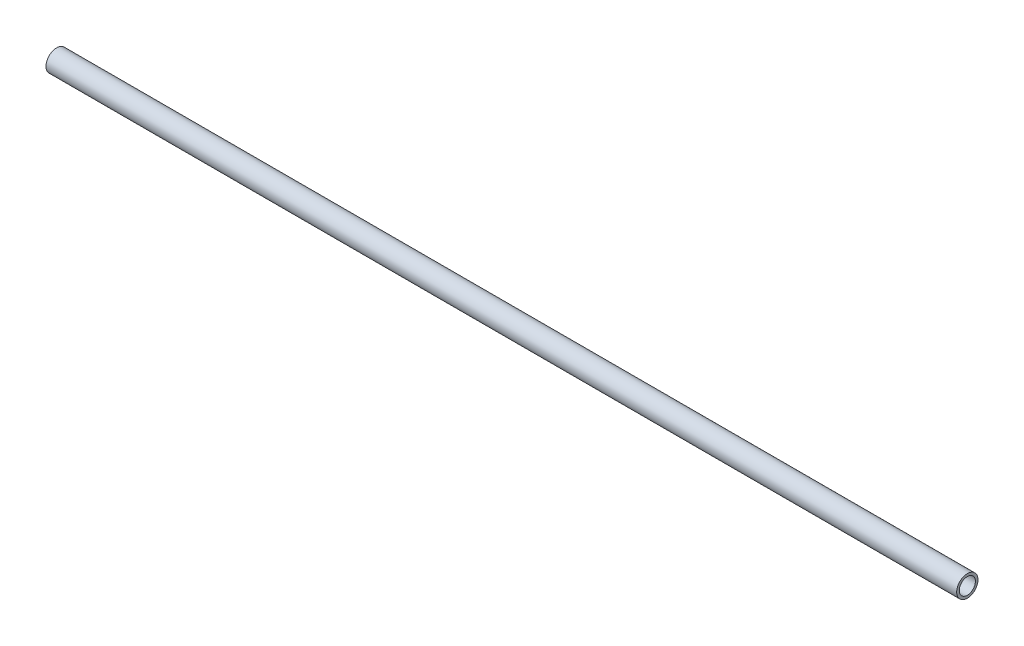
ISO-10303-21;
HEADER;
FILE_DESCRIPTION(('STEP AP214'),'2;1');
FILE_NAME('part.step','',(''),(''),'','','');
FILE_SCHEMA(('AUTOMOTIVE_DESIGN { 1 0 10303 214 1 1 1 1 }'));
ENDSEC;
DATA;
#1=APPLICATION_CONTEXT('core data for automotive mechanical design processes');
#2=APPLICATION_PROTOCOL_DEFINITION('international standard','automotive_design',2000,#1);
#3=PRODUCT_CONTEXT('',#1,'mechanical');
#4=PRODUCT('Part','Part','',(#3));
#5=PRODUCT_RELATED_PRODUCT_CATEGORY('part','',(#4));
#6=PRODUCT_DEFINITION_FORMATION('','',#4);
#7=PRODUCT_DEFINITION_CONTEXT('part definition',#1,'design');
#8=PRODUCT_DEFINITION('design','',#6,#7);
#9=PRODUCT_DEFINITION_SHAPE('','',#8);
#10=(LENGTH_UNIT() NAMED_UNIT(*) SI_UNIT(.MILLI.,.METRE.));
#11=(NAMED_UNIT(*) PLANE_ANGLE_UNIT() SI_UNIT($,.RADIAN.));
#12=(NAMED_UNIT(*) SI_UNIT($,.STERADIAN.) SOLID_ANGLE_UNIT());
#13=UNCERTAINTY_MEASURE_WITH_UNIT(LENGTH_MEASURE(1.E-05),#10,'distance_accuracy_value','');
#14=(GEOMETRIC_REPRESENTATION_CONTEXT(3) GLOBAL_UNCERTAINTY_ASSIGNED_CONTEXT((#13)) GLOBAL_UNIT_ASSIGNED_CONTEXT((#10,
#11,#12)) REPRESENTATION_CONTEXT('',''));
#15=CARTESIAN_POINT('',(0.,0.,0.));
#16=DIRECTION('',(0.,0.,1.));
#17=DIRECTION('',(1.,0.,0.));
#18=AXIS2_PLACEMENT_3D('',#15,#16,#17);
#19=CARTESIAN_POINT('',(90.,0.,0.));
#20=DIRECTION('',(1.,0.,0.));
#21=DIRECTION('',(0.,0.,-1.));
#22=AXIS2_PLACEMENT_3D('',#19,#20,#21);
#23=PLANE('',#22);
#24=CARTESIAN_POINT('',(90.,0.,0.));
#25=DIRECTION('',(1.,0.,0.));
#26=DIRECTION('',(0.,0.,-1.));
#27=AXIS2_PLACEMENT_3D('',#24,#25,#26);
#28=CIRCLE('',#27,1.0541);
#29=CARTESIAN_POINT('',(90.,0.,-1.0541));
#30=VERTEX_POINT('',#29);
#31=EDGE_CURVE('E144',#30,#30,#28,.T.);
#32=ORIENTED_EDGE('',*,*,#31,.T.);
#33=EDGE_LOOP('',(#32));
#34=FACE_BOUND('',#33,.T.);
#35=CARTESIAN_POINT('',(90.,0.,0.));
#36=DIRECTION('',(1.,0.,0.));
#37=DIRECTION('',(0.,0.,-1.));
#38=AXIS2_PLACEMENT_3D('',#35,#36,#37);
#39=CIRCLE('',#38,0.8001);
#40=CARTESIAN_POINT('',(90.,0.,-0.8001));
#41=VERTEX_POINT('',#40);
#42=EDGE_CURVE('E98',#41,#41,#39,.T.);
#43=ORIENTED_EDGE('',*,*,#42,.F.);
#44=EDGE_LOOP('',(#43));
#45=FACE_BOUND('',#44,.T.);
#46=ADVANCED_FACE('F33',(#34,#45),#23,.T.);
#47=CARTESIAN_POINT('',(0.,0.,0.));
#48=DIRECTION('',(1.,0.,0.));
#49=DIRECTION('',(0.,0.,-1.));
#50=AXIS2_PLACEMENT_3D('',#47,#48,#49);
#51=PLANE('',#50);
#52=CARTESIAN_POINT('',(0.,0.,0.));
#53=DIRECTION('',(1.,0.,0.));
#54=DIRECTION('',(0.,0.,-1.));
#55=AXIS2_PLACEMENT_3D('',#52,#53,#54);
#56=CIRCLE('',#55,1.0541);
#57=CARTESIAN_POINT('',(0.,0.,-1.0541));
#58=VERTEX_POINT('',#57);
#59=EDGE_CURVE('E146',#58,#58,#56,.T.);
#60=ORIENTED_EDGE('',*,*,#59,.F.);
#61=EDGE_LOOP('',(#60));
#62=FACE_BOUND('',#61,.T.);
#63=CARTESIAN_POINT('',(0.,0.,0.));
#64=DIRECTION('',(1.,0.,0.));
#65=DIRECTION('',(0.,0.,-1.));
#66=AXIS2_PLACEMENT_3D('',#63,#64,#65);
#67=CIRCLE('',#66,0.8001);
#68=CARTESIAN_POINT('',(0.,0.,-0.8001));
#69=VERTEX_POINT('',#68);
#70=EDGE_CURVE('E95',#69,#69,#67,.T.);
#71=ORIENTED_EDGE('',*,*,#70,.T.);
#72=EDGE_LOOP('',(#71));
#73=FACE_BOUND('',#72,.T.);
#74=ADVANCED_FACE('F158',(#62,#73),#51,.F.);
#75=CARTESIAN_POINT('',(90.,0.,0.));
#76=DIRECTION('',(-1.,0.,0.));
#77=DIRECTION('',(0.,0.,1.));
#78=AXIS2_PLACEMENT_3D('',#75,#76,#77);
#79=CYLINDRICAL_SURFACE('',#78,1.0541);
#80=DIRECTION('',(-1.,0.,0.));
#81=VECTOR('',#80,1.);
#82=CARTESIAN_POINT('',(90.,0.79375,-0.693604892932569));
#83=LINE('',#82,#81);
#84=CARTESIAN_POINT('',(4.22965786459374,0.79375,-0.693604892932567));
#85=VERTEX_POINT('',#84);
#86=CARTESIAN_POINT('',(1.07965786459374,0.79375,-0.693604892932569));
#87=VERTEX_POINT('',#86);
#88=EDGE_CURVE('E94',#85,#87,#83,.T.);
#89=ORIENTED_EDGE('',*,*,#88,.T.);
#90=CARTESIAN_POINT('',(1.07965786459374,0.79375,-0.693604892932567));
#91=CARTESIAN_POINT('',(1.06097650076287,0.793754302158675,-0.69359247993803));
#92=CARTESIAN_POINT('',(1.04231223508289,0.793090191085494,-0.69436031470599));
#93=CARTESIAN_POINT('',(1.005229850283,0.790470009943291,-0.697345228610568));
#94=CARTESIAN_POINT('',(0.986811293598215,0.788516678857944,-0.699559235212214));
#95=CARTESIAN_POINT('',(0.932622122592786,0.780856247540208,-0.708130425039182));
#96=CARTESIAN_POINT('',(0.897397203167143,0.773345984622935,-0.716422927180524));
#97=CARTESIAN_POINT('',(0.829603768208356,0.754155298401055,-0.736590197362163));
#98=CARTESIAN_POINT('',(0.797016823312525,0.742507559504099,-0.748436778719499));
#99=CARTESIAN_POINT('',(0.734239036964473,0.715469484959063,-0.774327217608681));
#100=CARTESIAN_POINT('',(0.704057751250156,0.700065123297631,-0.788379237773462));
#101=CARTESIAN_POINT('',(0.640174312285661,0.662228942353192,-0.820559528642505));
#102=CARTESIAN_POINT('',(0.607063395270207,0.639000712266537,-0.838924192889501));
#103=CARTESIAN_POINT('',(0.544695968844711,0.587778167834582,-0.875578890317217));
#104=CARTESIAN_POINT('',(0.515441644617538,0.559781171875426,-0.893868875545558));
#105=CARTESIAN_POINT('',(0.455527874305952,0.492863450316194,-0.932739772433391));
#106=CARTESIAN_POINT('',(0.425832185773999,0.452881224721931,-0.953010656015409));
#107=CARTESIAN_POINT('',(0.373887659986069,0.36666459507562,-0.989372403012117));
#108=CARTESIAN_POINT('',(0.351622469417229,0.320444239479246,-1.00547242808366));
#109=CARTESIAN_POINT('',(0.321524663051466,0.237860657499026,-1.02751382523747));
#110=CARTESIAN_POINT('',(0.311362500794273,0.202766377829282,-1.03505540472533));
#111=CARTESIAN_POINT('',(0.295926994558195,0.130956300347958,-1.04656329756168));
#112=CARTESIAN_POINT('',(0.29064928151658,0.0942419824980385,-1.05053280598323));
#113=CARTESIAN_POINT('',(0.285291062863292,0.0201199452583417,-1.05456305863377));
#114=CARTESIAN_POINT('',(0.285224336828193,-0.0172893509458742,-1.05461343938904));
#115=CARTESIAN_POINT('',(0.29032655497621,-0.0915462594727918,-1.05077537273126));
#116=CARTESIAN_POINT('',(0.295496690386011,-0.12839374206428,-1.04688602915075));
#117=CARTESIAN_POINT('',(0.31048570658938,-0.199193420608315,-1.03570739670066));
#118=CARTESIAN_POINT('',(0.320135685550259,-0.233201804717662,-1.02854176946564));
#119=CARTESIAN_POINT('',(0.343547137371748,-0.298999717571231,-1.01137704762977));
#120=CARTESIAN_POINT('',(0.357309575166656,-0.33078872340566,-1.00137728806549));
#121=CARTESIAN_POINT('',(0.390121038311679,-0.394987028174313,-0.977958224162252));
#122=CARTESIAN_POINT('',(0.409580401573969,-0.42709277051222,-0.964286294346073));
#123=CARTESIAN_POINT('',(0.452321179626761,-0.487714740168385,-0.935091093581731));
#124=CARTESIAN_POINT('',(0.475605424727434,-0.516228281536763,-0.919566454022395));
#125=CARTESIAN_POINT('',(0.530480061376216,-0.574766104604717,-0.884394621527938));
#126=CARTESIAN_POINT('',(0.562802860506998,-0.603978472312668,-0.86453838675115));
#127=CARTESIAN_POINT('',(0.631919569617189,-0.656860939575049,-0.825074353856983));
#128=CARTESIAN_POINT('',(0.66871835348482,-0.680524913942816,-0.805466852699236));
#129=CARTESIAN_POINT('',(0.739124028536789,-0.717873076438503,-0.77219536215681));
#130=CARTESIAN_POINT('',(0.771977428896138,-0.73260181211822,-0.758114459117832));
#131=CARTESIAN_POINT('',(0.840304246182429,-0.757669993472431,-0.733058635643747));
#132=CARTESIAN_POINT('',(0.875763480459972,-0.76803139271991,-0.722068274983034));
#133=CARTESIAN_POINT('',(0.939233432262899,-0.781711212737481,-0.707200978829105));
#134=CARTESIAN_POINT('',(0.966731288222226,-0.786167926359881,-0.702211171973755));
#135=CARTESIAN_POINT('',(1.02267311520765,-0.792213098542312,-0.695365423499634));
#136=CARTESIAN_POINT('',(1.05112348542466,-0.793774641637027,-0.69353890011247));
#137=CARTESIAN_POINT('',(1.07965786459374,-0.79375,-0.693604892932569));
#138=B_SPLINE_CURVE_WITH_KNOTS('',3,(#90,#91,#92,#93,#94,#95,#96,#97,#98,#99,#100,#101,#102,
#103,#104,#105,#106,#107,#108,#109,#110,#111,#112,#113,#114,#115,#116,#117,#118,#119,#120,#121,
#122,#123,#124,#125,#126,#127,#128,#129,#130,#131,#132,#133,#134,#135,#136,#137),.UNSPECIFIED.,
.F.,.F.,(4,2,2,2,2,2,2,2,2,2,2,2,2,2,2,2,2,2,2,2,2,2,2,4),(0.,0.0559864271356696,
0.111854290785416,0.222056996215594,0.3314078268173,0.441173362821062,0.573985149398091,
0.70687186791338,0.867279777259277,1.02733229030916,1.13878139857255,1.25013072074415,
1.36177447748187,1.47344363548265,1.58120744123691,1.68899655222985,1.80842276695392,
1.92793775529119,2.07103339640152,2.2142862728535,2.32990685286528,2.44493909647904,
2.52952236565082,2.61488810970727),.UNSPECIFIED.);
#139=CARTESIAN_POINT('',(1.07965786459374,-0.79375,-0.693604892932569));
#140=VERTEX_POINT('',#139);
#141=EDGE_CURVE('E87',#87,#140,#138,.T.);
#142=ORIENTED_EDGE('',*,*,#141,.T.);
#143=DIRECTION('',(-1.,0.,0.));
#144=VECTOR('',#143,1.);
#145=CARTESIAN_POINT('',(90.,-0.79375,-0.693604892932569));
#146=LINE('',#145,#144);
#147=CARTESIAN_POINT('',(4.22965786459374,-0.79375,-0.693604892932569));
#148=VERTEX_POINT('',#147);
#149=EDGE_CURVE('E76',#140,#148,#146,.F.);
#150=ORIENTED_EDGE('',*,*,#149,.T.);
#151=CARTESIAN_POINT('',(4.22965786459374,-0.79375,-0.693604892932567));
#152=CARTESIAN_POINT('',(4.24833922842462,-0.793754302158675,-0.69359247993803));
#153=CARTESIAN_POINT('',(4.2670034941046,-0.793090191085493,-0.69436031470599));
#154=CARTESIAN_POINT('',(4.30408587890448,-0.790470009943291,-0.697345228610568));
#155=CARTESIAN_POINT('',(4.32250443558927,-0.788516678857944,-0.699559235212214));
#156=CARTESIAN_POINT('',(4.3766936065947,-0.780856247540207,-0.708130425039183));
#157=CARTESIAN_POINT('',(4.41191852602035,-0.773345984622933,-0.716422927180526));
#158=CARTESIAN_POINT('',(4.47971196097914,-0.754155298401051,-0.736590197362166));
#159=CARTESIAN_POINT('',(4.51229890587497,-0.742507559504094,-0.748436778719503));
#160=CARTESIAN_POINT('',(4.57507669222303,-0.715469484959056,-0.774327217608688));
#161=CARTESIAN_POINT('',(4.60525797793734,-0.700065123297623,-0.78837923777347));
#162=CARTESIAN_POINT('',(4.66914141690184,-0.662228942353179,-0.820559528642515));
#163=CARTESIAN_POINT('',(4.7022523339173,-0.639000712266521,-0.838924192889513));
#164=CARTESIAN_POINT('',(4.7646197603428,-0.587778167834558,-0.875578890317233));
#165=CARTESIAN_POINT('',(4.79387408456997,-0.559781171875399,-0.893868875545576));
#166=CARTESIAN_POINT('',(4.85378785488156,-0.492863450316159,-0.93273977243341));
#167=CARTESIAN_POINT('',(4.88348354341351,-0.452881224721892,-0.953010656015428));
#168=CARTESIAN_POINT('',(4.93542806920144,-0.366664595075573,-0.989372403012134));
#169=CARTESIAN_POINT('',(4.95769325977028,-0.320444239479195,-1.00547242808368));
#170=CARTESIAN_POINT('',(4.98779106613603,-0.237860657498972,-1.02751382523749));
#171=CARTESIAN_POINT('',(4.99795322839323,-0.202766377829228,-1.03505540472534));
#172=CARTESIAN_POINT('',(5.0133887346293,-0.130956300347906,-1.04656329756169));
#173=CARTESIAN_POINT('',(5.01866644767091,-0.0942419824979876,-1.05053280598323));
#174=CARTESIAN_POINT('',(5.02402466632419,-0.0201199452582937,-1.05456305863377));
#175=CARTESIAN_POINT('',(5.02409139235929,0.0172893509459204,-1.05461343938904));
#176=CARTESIAN_POINT('',(5.01898917421127,0.091546259472834,-1.05077537273125));
#177=CARTESIAN_POINT('',(5.01381903880147,0.12839374206432,-1.04688602915074));
#178=CARTESIAN_POINT('',(4.99883002259809,0.199193420608351,-1.03570739670066));
#179=CARTESIAN_POINT('',(4.98918004363721,0.233201804717696,-1.02854176946564));
#180=CARTESIAN_POINT('',(4.96576859181572,0.298999717571263,-1.01137704762976));
#181=CARTESIAN_POINT('',(4.95200615402081,0.33078872340569,-1.00137728806548));
#182=CARTESIAN_POINT('',(4.91919469087579,0.394987028174341,-0.977958224162241));
#183=CARTESIAN_POINT('',(4.8997353276135,0.427092770512248,-0.964286294346061));
#184=CARTESIAN_POINT('',(4.8569945495607,0.487714740168411,-0.935091093581717));
#185=CARTESIAN_POINT('',(4.83371030446003,0.516228281536788,-0.919566454022381));
#186=CARTESIAN_POINT('',(4.77883566781124,0.574766104604741,-0.884394621527923));
#187=CARTESIAN_POINT('',(4.74651286868046,0.603978472312691,-0.864538386751134));
#188=CARTESIAN_POINT('',(4.67739615957026,0.65686093957507,-0.825074353856966));
#189=CARTESIAN_POINT('',(4.64059737570263,0.680524913942836,-0.805466852699219));
#190=CARTESIAN_POINT('',(4.57019170065066,0.71787307643852,-0.772195362156795));
#191=CARTESIAN_POINT('',(4.53733830029131,0.732601812118235,-0.758114459117817));
#192=CARTESIAN_POINT('',(4.46901148300502,0.757669993472442,-0.733058635643735));
#193=CARTESIAN_POINT('',(4.43355224872748,0.768031392719919,-0.722068274983024));
#194=CARTESIAN_POINT('',(4.37008229692455,0.781711212737486,-0.707200978829099));
#195=CARTESIAN_POINT('',(4.34258444096523,0.786167926359885,-0.702211171973751));
#196=CARTESIAN_POINT('',(4.28664261397982,0.792213098542313,-0.695365423499633));
#197=CARTESIAN_POINT('',(4.25819224376282,0.793774641637027,-0.693538900112469));
#198=CARTESIAN_POINT('',(4.22965786459374,0.79375,-0.693604892932569));
#199=B_SPLINE_CURVE_WITH_KNOTS('',3,(#151,#152,#153,#154,#155,#156,#157,#158,#159,#160,#161,
#162,#163,#164,#165,#166,#167,#168,#169,#170,#171,#172,#173,#174,#175,#176,#177,#178,#179,#180,
#181,#182,#183,#184,#185,#186,#187,#188,#189,#190,#191,#192,#193,#194,#195,#196,#197,#198),
.UNSPECIFIED.,.F.,.F.,(4,2,2,2,2,2,2,2,2,2,2,2,2,2,2,2,2,2,2,2,2,2,2,4),(0.,0.0559864271356725,
0.111854290785421,0.222056996215604,0.331407826817316,0.441173362821084,0.573985149398126,
0.706871867913427,0.86727977725933,1.02733229030922,1.1387813985726,1.2501307207442,
1.36177447748191,1.47344363548269,1.58120744123694,1.68899655222988,1.80842276695395,
1.92793775529123,2.07103339640156,2.21428627285354,2.32990685286532,2.44493909647907,
2.52952236565084,2.61488810970727),.UNSPECIFIED.);
#200=EDGE_CURVE('E81',#148,#85,#199,.T.);
#201=ORIENTED_EDGE('',*,*,#200,.T.);
#202=EDGE_LOOP('',(#89,#142,#150,#201));
#203=FACE_BOUND('',#202,.T.);
#204=ORIENTED_EDGE('',*,*,#31,.F.);
#205=EDGE_LOOP('',(#204));
#206=FACE_BOUND('',#205,.T.);
#207=ORIENTED_EDGE('',*,*,#59,.T.);
#208=EDGE_LOOP('',(#207));
#209=FACE_BOUND('',#208,.T.);
#210=ADVANCED_FACE('F35',(#203,#206,#209),#79,.T.);
#211=CARTESIAN_POINT('',(90.,0.,0.));
#212=DIRECTION('',(-1.,0.,0.));
#213=DIRECTION('',(0.,0.,1.));
#214=AXIS2_PLACEMENT_3D('',#211,#212,#213);
#215=CYLINDRICAL_SURFACE('',#214,0.8001);
#216=CARTESIAN_POINT('',(1.07965786459374,0.79375,-0.100602919937742));
#217=CARTESIAN_POINT('',(1.07260009999338,0.793752580415863,-0.100562752228033));
#218=CARTESIAN_POINT('',(1.0656131964436,0.793656269322355,-0.101344373984846));
#219=CARTESIAN_POINT('',(1.0520534160492,0.79329731920655,-0.104126543732192));
#220=CARTESIAN_POINT('',(1.04547463984961,0.793038700041046,-0.106097589311742));
#221=CARTESIAN_POINT('',(1.02512651207065,0.79199948542371,-0.113672782754282));
#222=CARTESIAN_POINT('',(1.01199096055756,0.790962622917239,-0.120824562683411));
#223=CARTESIAN_POINT('',(0.986526735979871,0.788372762566756,-0.136740865129245));
#224=CARTESIAN_POINT('',(0.974222029252654,0.786808960093339,-0.145537272654652));
#225=CARTESIAN_POINT('',(0.936175655293873,0.781119807854132,-0.174383438233588));
#226=CARTESIAN_POINT('',(0.911460790978969,0.77613131074895,-0.195616409962328));
#227=CARTESIAN_POINT('',(0.863034471248664,0.764021091266688,-0.238630839757729));
#228=CARTESIAN_POINT('',(0.839325241722288,0.756894892542658,-0.260413360045415));
#229=CARTESIAN_POINT('',(0.7928104913249,0.740515375406274,-0.303858368517974));
#230=CARTESIAN_POINT('',(0.770000277505968,0.731275523925843,-0.32552076325258));
#231=CARTESIAN_POINT('',(0.725109410776731,0.710593606059413,-0.368491808730466));
#232=CARTESIAN_POINT('',(0.70302816403573,0.699153386732922,-0.38980073999955));
#233=CARTESIAN_POINT('',(0.637631919707409,0.661218594342199,-0.453198381357721));
#234=CARTESIAN_POINT('',(0.595471116939003,0.631215250936409,-0.494465780416442));
#235=CARTESIAN_POINT('',(0.515755332413795,0.561120754372067,-0.5727618946995));
#236=CARTESIAN_POINT('',(0.478192542241739,0.521047066440065,-0.609797788597676));
#237=CARTESIAN_POINT('',(0.423432462299081,0.447897062977243,-0.663884104597088));
#238=CARTESIAN_POINT('',(0.403981807623953,0.418121016511048,-0.6831197407648));
#239=CARTESIAN_POINT('',(0.368627581117735,0.354667305397305,-0.718107672790183));
#240=CARTESIAN_POINT('',(0.352718640237664,0.320995665669055,-0.733865240899397));
#241=CARTESIAN_POINT('',(0.327475183909554,0.255534879614495,-0.75887898317842));
#242=CARTESIAN_POINT('',(0.317510634572041,0.224229389667027,-0.768757614386306));
#243=CARTESIAN_POINT('',(0.301431171790593,0.159703456615445,-0.784701626280686));
#244=CARTESIAN_POINT('',(0.295314149157752,0.126484073617363,-0.790769096218304));
#245=CARTESIAN_POINT('',(0.287360562893429,0.0588787269369839,-0.798658689770376));
#246=CARTESIAN_POINT('',(0.28554283175774,0.0244882976477747,-0.800462135360367));
#247=CARTESIAN_POINT('',(0.28639502387974,-0.0441793263731721,-0.799616707520222));
#248=CARTESIAN_POINT('',(0.289064571630048,-0.0784565303394007,-0.796968206640758));
#249=CARTESIAN_POINT('',(0.298322670426837,-0.143360422925039,-0.787785072442504));
#250=CARTESIAN_POINT('',(0.304616177325643,-0.174072541596123,-0.781543015496891));
#251=CARTESIAN_POINT('',(0.320480174121004,-0.23375971866553,-0.765813727172332));
#252=CARTESIAN_POINT('',(0.330052118288487,-0.262733999468163,-0.756325055640473));
#253=CARTESIAN_POINT('',(0.355761949879318,-0.328074133554567,-0.730850332898736));
#254=CARTESIAN_POINT('',(0.373025825621833,-0.363563740422262,-0.713752016258492));
#255=CARTESIAN_POINT('',(0.411427054393516,-0.430103956767309,-0.6757556823063));
#256=CARTESIAN_POINT('',(0.432569924479873,-0.4611481301282,-0.654852253353879));
#257=CARTESIAN_POINT('',(0.485992897783563,-0.529238313476643,-0.602108130385278));
#258=CARTESIAN_POINT('',(0.519527727551753,-0.564364044051201,-0.569053760331396));
#259=CARTESIAN_POINT('',(0.572567631693679,-0.611112128085866,-0.516962733886401));
#260=CARTESIAN_POINT('',(0.590751606888933,-0.625733086887052,-0.49913423083148));
#261=CARTESIAN_POINT('',(0.627884617383977,-0.65304692543149,-0.462823003530886));
#262=CARTESIAN_POINT('',(0.646833224499566,-0.66574086582363,-0.444340646131228));
#263=CARTESIAN_POINT('',(0.691230714040923,-0.692842684826605,-0.401198034678774));
#264=CARTESIAN_POINT('',(0.716907407303812,-0.70660192687858,-0.376364861437129));
#265=CARTESIAN_POINT('',(0.769293383491798,-0.73112980438965,-0.326178746315637));
#266=CARTESIAN_POINT('',(0.796005206667303,-0.741890472069134,-0.3008246082839));
#267=CARTESIAN_POINT('',(0.850289361859094,-0.760429566579298,-0.250242215568819));
#268=CARTESIAN_POINT('',(0.877856140385093,-0.768224101621745,-0.22501403717036));
#269=CARTESIAN_POINT('',(0.920449584203122,-0.777753320963775,-0.188206910895324));
#270=CARTESIAN_POINT('',(0.9348207719926,-0.780565367231234,-0.176136487765467));
#271=CARTESIAN_POINT('',(0.964296839426871,-0.785465659823442,-0.152781253497166));
#272=CARTESIAN_POINT('',(0.979399880201927,-0.787555622850149,-0.141494630739641));
#273=CARTESIAN_POINT('',(1.00278810273053,-0.790054714995639,-0.126484948419215));
#274=CARTESIAN_POINT('',(1.01047922061719,-0.790769628259772,-0.12190695682303));
#275=CARTESIAN_POINT('',(1.02627870190088,-0.791992462553468,-0.113686370551512));
#276=CARTESIAN_POINT('',(1.03438141157852,-0.792502617332124,-0.110033851389558));
#277=CARTESIAN_POINT('',(1.04863481877004,-0.793164902784871,-0.105138056178755));
#278=CARTESIAN_POINT('',(1.05463996231439,-0.793378560634889,-0.10350059254709));
#279=CARTESIAN_POINT('',(1.06696488007649,-0.793673483690896,-0.101208528467252));
#280=CARTESIAN_POINT('',(1.07328863941051,-0.793751812580565,-0.100575750367154));
#281=CARTESIAN_POINT('',(1.07965786459375,-0.793750000000001,-0.100602919937775));
#282=B_SPLINE_CURVE_WITH_KNOTS('',3,(#216,#217,#218,#219,#220,#221,#222,#223,#224,#225,#226,
#227,#228,#229,#230,#231,#232,#233,#234,#235,#236,#237,#238,#239,#240,#241,#242,#243,#244,#245,
#246,#247,#248,#249,#250,#251,#252,#253,#254,#255,#256,#257,#258,#259,#260,#261,#262,#263,#264,
#265,#266,#267,#268,#269,#270,#271,#272,#273,#274,#275,#276,#277,#278,#279,#280,#281),
.UNSPECIFIED.,.F.,.F.,(4,2,2,2,2,2,2,2,2,2,2,2,2,2,2,2,2,2,2,2,2,2,2,2,2,2,2,2,2,2,2,2,4),(0.,
0.0210183429681526,0.0415356257350441,0.0861604757002492,0.131762472906189,0.230432679498222,
0.329310961145965,0.42757598059926,0.525758870429254,0.723421466360158,0.920743589358996,
1.04164903818636,1.16236993347871,1.26485955792896,1.36729294915946,1.47017421240548,
1.57304686670351,1.66853571408115,1.76406697401092,1.892386568983,2.02089010685359,
2.19610476258023,2.28414267478119,2.37213195301882,2.48681935849935,2.60180866567349,
2.71616427095236,2.77308560425218,2.82987066456287,2.85677671440048,2.88338069580867,
2.90198601642329,2.92099018321528),.UNSPECIFIED.);
#283=CARTESIAN_POINT('',(1.07965786459374,0.79375,-0.100602919937744));
#284=VERTEX_POINT('',#283);
#285=CARTESIAN_POINT('',(1.07965786459374,-0.79375,-0.100602919937744));
#286=VERTEX_POINT('',#285);
#287=EDGE_CURVE('E11',#284,#286,#282,.T.);
#288=ORIENTED_EDGE('',*,*,#287,.F.);
#289=DIRECTION('',(-1.,0.,0.));
#290=VECTOR('',#289,1.);
#291=CARTESIAN_POINT('',(90.,0.79375,-0.100602919937744));
#292=LINE('',#291,#290);
#293=CARTESIAN_POINT('',(4.22965786459374,0.79375,-0.100602919937742));
#294=VERTEX_POINT('',#293);
#295=EDGE_CURVE('E47',#294,#284,#292,.T.);
#296=ORIENTED_EDGE('',*,*,#295,.F.);
#297=CARTESIAN_POINT('',(4.22965786459374,-0.79375,-0.100602919937742));
#298=CARTESIAN_POINT('',(4.23671562919411,-0.793752580415863,-0.100562752228033));
#299=CARTESIAN_POINT('',(4.24370253274389,-0.793656269322354,-0.101344373984848));
#300=CARTESIAN_POINT('',(4.2572623131383,-0.79329731920655,-0.104126543732197));
#301=CARTESIAN_POINT('',(4.2638410893379,-0.793038700041045,-0.106097589311749));
#302=CARTESIAN_POINT('',(4.28418921711688,-0.791999485423707,-0.113672782754303));
#303=CARTESIAN_POINT('',(4.29732476863,-0.790962622917233,-0.12082456268345));
#304=CARTESIAN_POINT('',(4.32278899320773,-0.788372762566743,-0.136740865129322));
#305=CARTESIAN_POINT('',(4.33509369993496,-0.786808960093322,-0.145537272654749));
#306=CARTESIAN_POINT('',(4.37314007389381,-0.781119807854097,-0.174383438233753));
#307=CARTESIAN_POINT('',(4.39785493820876,-0.776131310748898,-0.195616409962542));
#308=CARTESIAN_POINT('',(4.44628125793916,-0.764021091266593,-0.238630839758039));
#309=CARTESIAN_POINT('',(4.46999048746558,-0.756894892542537,-0.260413360045772));
#310=CARTESIAN_POINT('',(4.51650523786306,-0.740515375406092,-0.303858368518422));
#311=CARTESIAN_POINT('',(4.53931545168203,-0.731275523925625,-0.325520763253072));
#312=CARTESIAN_POINT('',(4.58420631841135,-0.710593606059116,-0.368491808731043));
#313=CARTESIAN_POINT('',(4.60628756515239,-0.699153386732579,-0.389800740000167));
#314=CARTESIAN_POINT('',(4.67168380948083,-0.661218594341702,-0.453198381358459));
#315=CARTESIAN_POINT('',(4.71384461224931,-0.631215250935784,-0.494465780417254));
#316=CARTESIAN_POINT('',(4.79356039677462,-0.561120754371138,-0.572761894700423));
#317=CARTESIAN_POINT('',(4.83112318694672,-0.521047066438959,-0.609797788598637));
#318=CARTESIAN_POINT('',(4.8858832668893,-0.447897062975921,-0.663884104597978));
#319=CARTESIAN_POINT('',(4.90533392156435,-0.418121016509718,-0.683119740765612));
#320=CARTESIAN_POINT('',(4.94068814807041,-0.354667305395977,-0.718107672790837));
#321=CARTESIAN_POINT('',(4.9565970889504,-0.320995665667736,-0.733865240899972));
#322=CARTESIAN_POINT('',(4.98184054527837,-0.255534879613187,-0.758878983178859));
#323=CARTESIAN_POINT('',(4.99180509461583,-0.224229389665717,-0.768757614386687));
#324=CARTESIAN_POINT('',(5.00788455739716,-0.159703456614145,-0.78470162628095));
#325=CARTESIAN_POINT('',(5.01400158002994,-0.126484073616075,-0.790769096218509));
#326=CARTESIAN_POINT('',(5.02195516629415,-0.0588787269357361,-0.798658689770467));
#327=CARTESIAN_POINT('',(5.02377289742978,-0.0244882976465557,-0.800462135360403));
#328=CARTESIAN_POINT('',(5.02292070530768,0.0441793263743203,-0.799616707520157));
#329=CARTESIAN_POINT('',(5.02025115755732,0.0784565303405072,-0.796968206640648));
#330=CARTESIAN_POINT('',(5.01099305876045,0.143360422926087,-0.787785072442313));
#331=CARTESIAN_POINT('',(5.00469955186161,0.174072541597153,-0.781543015496661));
#332=CARTESIAN_POINT('',(4.98883555506617,0.233759718666519,-0.76581372717203));
#333=CARTESIAN_POINT('',(4.97926361089866,0.262733999469129,-0.756325055640137));
#334=CARTESIAN_POINT('',(4.95355377930773,0.328074133555524,-0.730850332898308));
#335=CARTESIAN_POINT('',(4.93628990356516,0.363563740423227,-0.713752016258002));
#336=CARTESIAN_POINT('',(4.89788867479335,0.430103956768275,-0.675755682305687));
#337=CARTESIAN_POINT('',(4.87674580470693,0.46114813012916,-0.654852253353205));
#338=CARTESIAN_POINT('',(4.82332283140309,0.529238313477583,-0.602108130384457));
#339=CARTESIAN_POINT('',(4.78978800163481,0.564364044052121,-0.569053760330487));
#340=CARTESIAN_POINT('',(4.73674809749275,0.611112128086746,-0.516962733885363));
#341=CARTESIAN_POINT('',(4.71856412229745,0.625733086887917,-0.499134230830397));
#342=CARTESIAN_POINT('',(4.68143111180231,0.653046925432321,-0.462823003529716));
#343=CARTESIAN_POINT('',(4.66248250468667,0.665740865824441,-0.444340646130014));
#344=CARTESIAN_POINT('',(4.61808501514526,0.692842684827335,-0.401198034677511));
#345=CARTESIAN_POINT('',(4.59240832188236,0.706601926879253,-0.376364861435862));
#346=CARTESIAN_POINT('',(4.54002234569435,0.731129804390216,-0.326178746314367));
#347=CARTESIAN_POINT('',(4.51331052251883,0.741890472069648,-0.30082460828263));
#348=CARTESIAN_POINT('',(4.45902636732703,0.760429566579707,-0.250242215567572));
#349=CARTESIAN_POINT('',(4.43145958880103,0.768224101622102,-0.225014037169135));
#350=CARTESIAN_POINT('',(4.38886614498299,0.777753320964055,-0.188206910894163));
#351=CARTESIAN_POINT('',(4.37449495719351,0.78056536723149,-0.176136487764333));
#352=CARTESIAN_POINT('',(4.34501888975921,0.785465659823647,-0.152781253496106));
#353=CARTESIAN_POINT('',(4.32991584898414,0.787555622850329,-0.141494630738629));
#354=CARTESIAN_POINT('',(4.30652762645557,0.790054714995773,-0.126484948418372));
#355=CARTESIAN_POINT('',(4.29883650856896,0.790769628259888,-0.121906956822276));
#356=CARTESIAN_POINT('',(4.2830370272854,0.791992462553549,-0.113686370550945));
#357=CARTESIAN_POINT('',(4.27493431760781,0.792502617332189,-0.110033851389088));
#358=CARTESIAN_POINT('',(4.26068091041652,0.793164902784906,-0.10513805617849));
#359=CARTESIAN_POINT('',(4.25467576687234,0.793378560634912,-0.103500592546918));
#360=CARTESIAN_POINT('',(4.24235084911061,0.793673483690901,-0.101208528467214));
#361=CARTESIAN_POINT('',(4.23602708977677,0.793751812580565,-0.100575750367156));
#362=CARTESIAN_POINT('',(4.22965786459373,0.793750000000001,-0.100602919937775));
#363=B_SPLINE_CURVE_WITH_KNOTS('',3,(#297,#298,#299,#300,#301,#302,#303,#304,#305,#306,#307,
#308,#309,#310,#311,#312,#313,#314,#315,#316,#317,#318,#319,#320,#321,#322,#323,#324,#325,#326,
#327,#328,#329,#330,#331,#332,#333,#334,#335,#336,#337,#338,#339,#340,#341,#342,#343,#344,#345,
#346,#347,#348,#349,#350,#351,#352,#353,#354,#355,#356,#357,#358,#359,#360,#361,#362),
.UNSPECIFIED.,.F.,.F.,(4,2,2,2,2,2,2,2,2,2,2,2,2,2,2,2,2,2,2,2,2,2,2,2,2,2,2,2,2,2,2,2,4),(0.,
0.0210183429681665,0.0415356257350717,0.0861604757003577,0.131762472906383,0.230432679498624,
0.329310961146573,0.427575980600074,0.525758870430274,0.723421466361618,0.920743589360888,
1.04164903818804,1.16236993348018,1.26485955793033,1.36729294916074,1.47017421240666,
1.57304686670459,1.66853571408222,1.764066974012,1.89238656898424,2.020890106855,
2.1961047625819,2.28414267478301,2.37213195302078,2.48681935850127,2.6018086656754,
2.71616427095419,2.77308560425396,2.82987066456459,2.8567767144019,2.8833806958098,
2.90198601642387,2.92099018321528),.UNSPECIFIED.);
#364=CARTESIAN_POINT('',(4.22965786459374,-0.79375,-0.100602919937744));
#365=VERTEX_POINT('',#364);
#366=EDGE_CURVE('E119',#365,#294,#363,.T.);
#367=ORIENTED_EDGE('',*,*,#366,.F.);
#368=DIRECTION('',(-1.,0.,0.));
#369=VECTOR('',#368,1.);
#370=CARTESIAN_POINT('',(90.,-0.79375,-0.100602919937744));
#371=LINE('',#370,#369);
#372=EDGE_CURVE('E124',#286,#365,#371,.F.);
#373=ORIENTED_EDGE('',*,*,#372,.F.);
#374=EDGE_LOOP('',(#288,#296,#367,#373));
#375=FACE_BOUND('',#374,.T.);
#376=ORIENTED_EDGE('',*,*,#42,.T.);
#377=EDGE_LOOP('',(#376));
#378=FACE_BOUND('',#377,.T.);
#379=ORIENTED_EDGE('',*,*,#70,.F.);
#380=EDGE_LOOP('',(#379));
#381=FACE_BOUND('',#380,.T.);
#382=ADVANCED_FACE('F110',(#375,#378,#381),#215,.F.);
#383=CARTESIAN_POINT('',(1.07965786459374,0.,-10.));
#384=DIRECTION('',(0.,0.,1.));
#385=DIRECTION('',(1.,0.,0.));
#386=AXIS2_PLACEMENT_3D('',#383,#384,#385);
#387=CYLINDRICAL_SURFACE('',#386,0.79375);
#388=DIRECTION('',(0.,0.,1.));
#389=VECTOR('',#388,1.);
#390=CARTESIAN_POINT('',(1.07965786459374,0.79375,-10.));
#391=LINE('',#390,#389);
#392=EDGE_CURVE('E82',#87,#284,#391,.T.);
#393=ORIENTED_EDGE('',*,*,#392,.T.);
#394=ORIENTED_EDGE('',*,*,#287,.T.);
#395=DIRECTION('',(0.,0.,1.));
#396=VECTOR('',#395,1.);
#397=CARTESIAN_POINT('',(1.07965786459374,-0.79375,-10.));
#398=LINE('',#397,#396);
#399=EDGE_CURVE('E59',#140,#286,#398,.T.);
#400=ORIENTED_EDGE('',*,*,#399,.F.);
#401=ORIENTED_EDGE('',*,*,#141,.F.);
#402=EDGE_LOOP('',(#393,#394,#400,#401));
#403=FACE_BOUND('',#402,.T.);
#404=ADVANCED_FACE('F86',(#403),#387,.F.);
#405=CARTESIAN_POINT('',(1.07965786459374,0.79375,-10.));
#406=DIRECTION('',(0.,1.,0.));
#407=DIRECTION('',(0.,0.,1.));
#408=AXIS2_PLACEMENT_3D('',#405,#406,#407);
#409=PLANE('',#408);
#410=DIRECTION('',(0.,0.,1.));
#411=VECTOR('',#410,1.);
#412=CARTESIAN_POINT('',(4.22965786459374,0.79375,-10.));
#413=LINE('',#412,#411);
#414=EDGE_CURVE('E137',#85,#294,#413,.T.);
#415=ORIENTED_EDGE('',*,*,#414,.T.);
#416=ORIENTED_EDGE('',*,*,#295,.T.);
#417=ORIENTED_EDGE('',*,*,#392,.F.);
#418=ORIENTED_EDGE('',*,*,#88,.F.);
#419=EDGE_LOOP('',(#415,#416,#417,#418));
#420=FACE_BOUND('',#419,.T.);
#421=ADVANCED_FACE('F109',(#420),#409,.F.);
#422=CARTESIAN_POINT('',(4.22965786459374,0.,-10.));
#423=DIRECTION('',(0.,0.,1.));
#424=DIRECTION('',(1.,0.,0.));
#425=AXIS2_PLACEMENT_3D('',#422,#423,#424);
#426=CYLINDRICAL_SURFACE('',#425,0.79375);
#427=DIRECTION('',(0.,0.,1.));
#428=VECTOR('',#427,1.);
#429=CARTESIAN_POINT('',(4.22965786459374,-0.79375,-10.));
#430=LINE('',#429,#428);
#431=EDGE_CURVE('E54',#148,#365,#430,.T.);
#432=ORIENTED_EDGE('',*,*,#431,.T.);
#433=ORIENTED_EDGE('',*,*,#366,.T.);
#434=ORIENTED_EDGE('',*,*,#414,.F.);
#435=ORIENTED_EDGE('',*,*,#200,.F.);
#436=EDGE_LOOP('',(#432,#433,#434,#435));
#437=FACE_BOUND('',#436,.T.);
#438=ADVANCED_FACE('F126',(#437),#426,.F.);
#439=CARTESIAN_POINT('',(1.07965786459374,-0.79375,-10.));
#440=DIRECTION('',(0.,-1.,0.));
#441=DIRECTION('',(0.,0.,-1.));
#442=AXIS2_PLACEMENT_3D('',#439,#440,#441);
#443=PLANE('',#442);
#444=ORIENTED_EDGE('',*,*,#399,.T.);
#445=ORIENTED_EDGE('',*,*,#372,.T.);
#446=ORIENTED_EDGE('',*,*,#431,.F.);
#447=ORIENTED_EDGE('',*,*,#149,.F.);
#448=EDGE_LOOP('',(#444,#445,#446,#447));
#449=FACE_BOUND('',#448,.T.);
#450=ADVANCED_FACE('F77',(#449),#443,.F.);
#451=CLOSED_SHELL('',(#46,#74,#210,#382,#404,#421,#438,#450));
#452=MANIFOLD_SOLID_BREP('B2',#451);
#453=ADVANCED_BREP_SHAPE_REPRESENTATION('',(#18,#452),#14);
#454=SHAPE_DEFINITION_REPRESENTATION(#9,#453);
ENDSEC;
END-ISO-10303-21;
